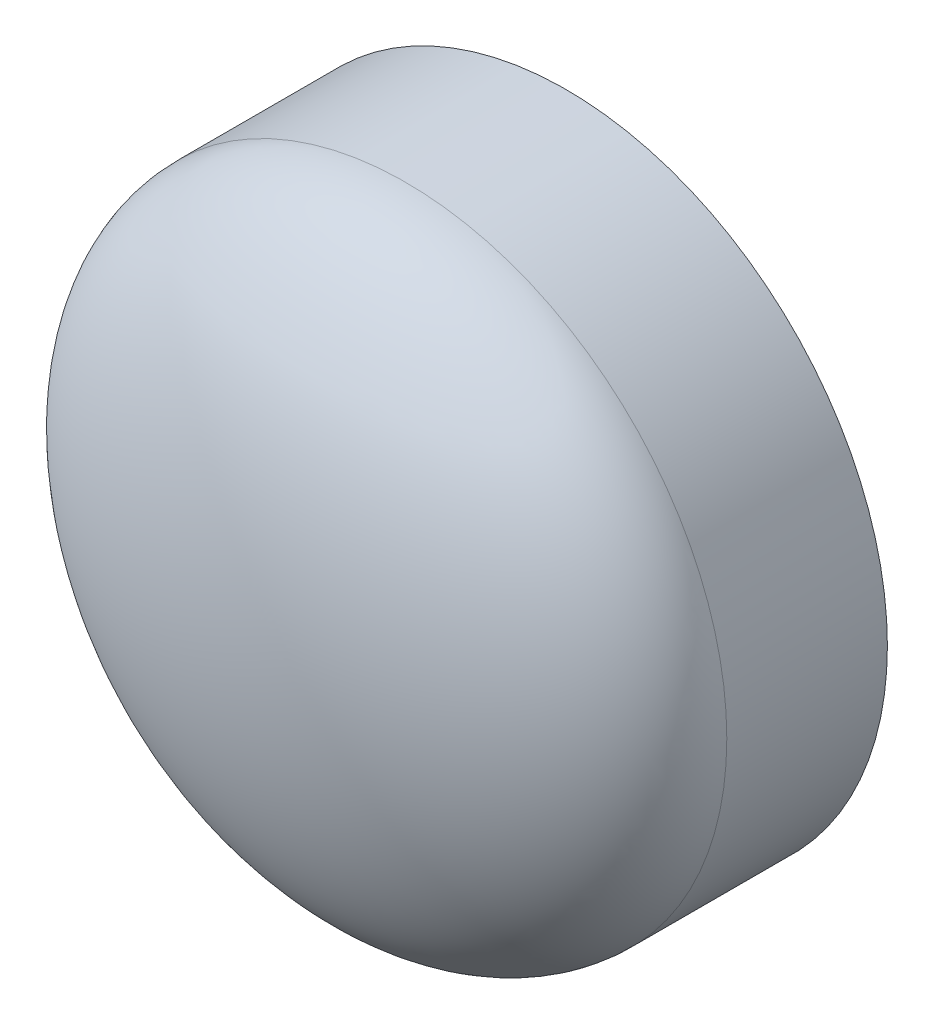
ISO-10303-21;
HEADER;
FILE_DESCRIPTION(('STEP AP214'),'2;1');
FILE_NAME('part.step','',(''),(''),'','','');
FILE_SCHEMA(('AUTOMOTIVE_DESIGN { 1 0 10303 214 1 1 1 1 }'));
ENDSEC;
DATA;
#1=APPLICATION_CONTEXT('core data for automotive mechanical design processes');
#2=APPLICATION_PROTOCOL_DEFINITION('international standard','automotive_design',2000,#1);
#3=PRODUCT_CONTEXT('',#1,'mechanical');
#4=PRODUCT('Part','Part','',(#3));
#5=PRODUCT_RELATED_PRODUCT_CATEGORY('part','',(#4));
#6=PRODUCT_DEFINITION_FORMATION('','',#4);
#7=PRODUCT_DEFINITION_CONTEXT('part definition',#1,'design');
#8=PRODUCT_DEFINITION('design','',#6,#7);
#9=PRODUCT_DEFINITION_SHAPE('','',#8);
#10=(LENGTH_UNIT() NAMED_UNIT(*) SI_UNIT(.MILLI.,.METRE.));
#11=(NAMED_UNIT(*) PLANE_ANGLE_UNIT() SI_UNIT($,.RADIAN.));
#12=(NAMED_UNIT(*) SI_UNIT($,.STERADIAN.) SOLID_ANGLE_UNIT());
#13=UNCERTAINTY_MEASURE_WITH_UNIT(LENGTH_MEASURE(1.E-05),#10,'distance_accuracy_value','');
#14=(GEOMETRIC_REPRESENTATION_CONTEXT(3) GLOBAL_UNCERTAINTY_ASSIGNED_CONTEXT((#13)) GLOBAL_UNIT_ASSIGNED_CONTEXT((#10,
#11,#12)) REPRESENTATION_CONTEXT('',''));
#15=CARTESIAN_POINT('',(0.,0.,0.));
#16=DIRECTION('',(0.,0.,1.));
#17=DIRECTION('',(1.,0.,0.));
#18=AXIS2_PLACEMENT_3D('',#15,#16,#17);
#19=CARTESIAN_POINT('',(0.,0.,0.79375));
#20=DIRECTION('',(0.,0.,-1.));
#21=DIRECTION('',(-1.,0.,0.));
#22=AXIS2_PLACEMENT_3D('',#19,#20,#21);
#23=CYLINDRICAL_SURFACE('',#22,1.5875);
#24=CARTESIAN_POINT('',(0.,0.,0.79375));
#25=DIRECTION('',(0.,0.,1.));
#26=DIRECTION('',(1.,0.,0.));
#27=AXIS2_PLACEMENT_3D('',#24,#25,#26);
#28=CIRCLE('',#27,1.5875);
#29=CARTESIAN_POINT('',(1.5875,0.,0.79375));
#30=VERTEX_POINT('',#29);
#31=EDGE_CURVE('E13',#30,#30,#28,.T.);
#32=ORIENTED_EDGE('',*,*,#31,.F.);
#33=EDGE_LOOP('',(#32));
#34=FACE_BOUND('',#33,.T.);
#35=CARTESIAN_POINT('',(0.,0.,0.));
#36=DIRECTION('',(0.,0.,1.));
#37=DIRECTION('',(1.,0.,0.));
#38=AXIS2_PLACEMENT_3D('',#35,#36,#37);
#39=CIRCLE('',#38,1.5875);
#40=CARTESIAN_POINT('',(1.5875,0.,0.));
#41=VERTEX_POINT('',#40);
#42=EDGE_CURVE('E55',#41,#41,#39,.T.);
#43=ORIENTED_EDGE('',*,*,#42,.T.);
#44=EDGE_LOOP('',(#43));
#45=FACE_BOUND('',#44,.T.);
#46=ADVANCED_FACE('F47',(#34,#45),#23,.T.);
#47=CARTESIAN_POINT('',(0.,0.,0.79375));
#48=DIRECTION('',(0.,1.,0.));
#49=DIRECTION('',(1.,0.,0.));
#50=AXIS2_PLACEMENT_3D('',#47,#48,#49);
#51=ELLIPSE('',#50,1.5875,0.79375);
#52=TRIMMED_CURVE('',#51,(PARAMETER_VALUE(4.71238898038469)),
(PARAMETER_VALUE(7.85398163397448)),.T.,.PARAMETER.);
#53=CARTESIAN_POINT('',(0.,0.,0.));
#54=DIRECTION('',(0.,0.,1.));
#55=AXIS1_PLACEMENT('',#53,#54);
#56=SURFACE_OF_REVOLUTION('',#52,#55);
#57=CARTESIAN_POINT('',(0.,0.,1.5875));
#58=VERTEX_POINT('',#57);
#59=VERTEX_LOOP('',#58);
#60=FACE_BOUND('',#59,.T.);
#61=ORIENTED_EDGE('',*,*,#31,.T.);
#62=EDGE_LOOP('',(#61));
#63=FACE_BOUND('',#62,.T.);
#64=ADVANCED_FACE('F49',(#60,#63),#56,.F.);
#65=CARTESIAN_POINT('',(0.,0.,0.));
#66=DIRECTION('',(0.,0.,1.));
#67=DIRECTION('',(1.,0.,0.));
#68=AXIS2_PLACEMENT_3D('',#65,#66,#67);
#69=PLANE('',#68);
#70=ORIENTED_EDGE('',*,*,#42,.F.);
#71=EDGE_LOOP('',(#70));
#72=FACE_BOUND('',#71,.T.);
#73=ADVANCED_FACE('F60',(#72),#69,.F.);
#74=CLOSED_SHELL('',(#46,#64,#73));
#75=MANIFOLD_SOLID_BREP('B2',#74);
#76=ADVANCED_BREP_SHAPE_REPRESENTATION('',(#18,#75),#14);
#77=SHAPE_DEFINITION_REPRESENTATION(#9,#76);
ENDSEC;
END-ISO-10303-21;
